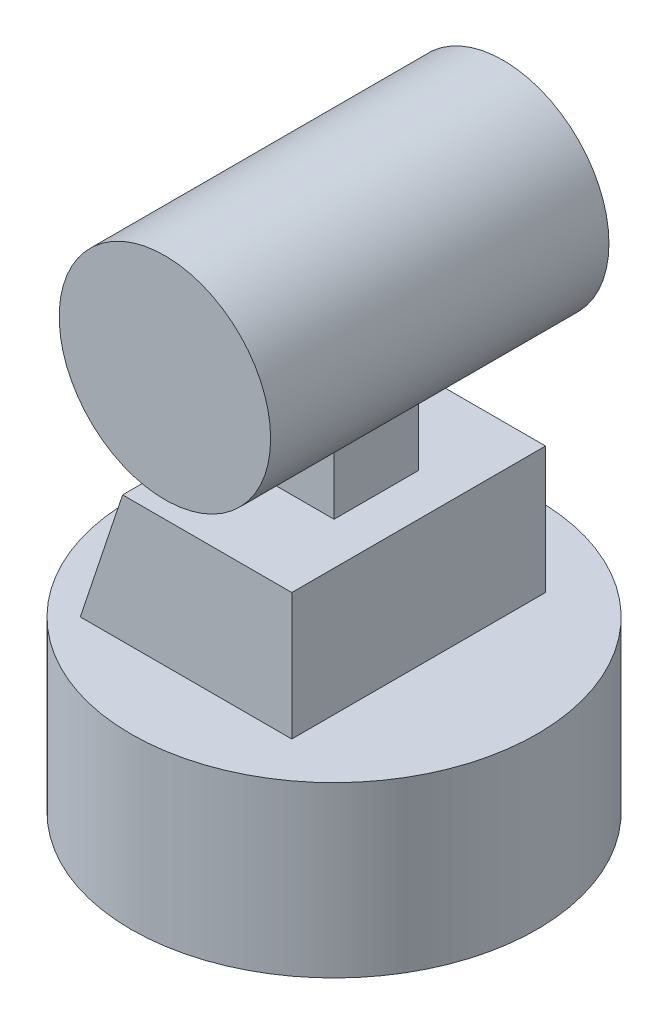
ISO-10303-21;
HEADER;
FILE_DESCRIPTION(('STEP AP214'),'2;1');
FILE_NAME('part.step','',(''),(''),'','','');
FILE_SCHEMA(('AUTOMOTIVE_DESIGN { 1 0 10303 214 1 1 1 1 }'));
ENDSEC;
DATA;
#1=APPLICATION_CONTEXT('core data for automotive mechanical design processes');
#2=APPLICATION_PROTOCOL_DEFINITION('international standard','automotive_design',2000,#1);
#3=PRODUCT_CONTEXT('',#1,'mechanical');
#4=PRODUCT('Part','Part','',(#3));
#5=PRODUCT_RELATED_PRODUCT_CATEGORY('part','',(#4));
#6=PRODUCT_DEFINITION_FORMATION('','',#4);
#7=PRODUCT_DEFINITION_CONTEXT('part definition',#1,'design');
#8=PRODUCT_DEFINITION('design','',#6,#7);
#9=PRODUCT_DEFINITION_SHAPE('','',#8);
#10=(LENGTH_UNIT() NAMED_UNIT(*) SI_UNIT(.MILLI.,.METRE.));
#11=(NAMED_UNIT(*) PLANE_ANGLE_UNIT() SI_UNIT($,.RADIAN.));
#12=(NAMED_UNIT(*) SI_UNIT($,.STERADIAN.) SOLID_ANGLE_UNIT());
#13=UNCERTAINTY_MEASURE_WITH_UNIT(LENGTH_MEASURE(1.E-05),#10,'distance_accuracy_value','');
#14=(GEOMETRIC_REPRESENTATION_CONTEXT(3) GLOBAL_UNCERTAINTY_ASSIGNED_CONTEXT((#13)) GLOBAL_UNIT_ASSIGNED_CONTEXT((#10,
#11,#12)) REPRESENTATION_CONTEXT('',''));
#15=CARTESIAN_POINT('',(0.,0.,0.));
#16=DIRECTION('',(0.,0.,1.));
#17=DIRECTION('',(1.,0.,0.));
#18=AXIS2_PLACEMENT_3D('',#15,#16,#17);
#19=CARTESIAN_POINT('',(0.,54.5,20.));
#20=DIRECTION('',(0.,0.,-1.));
#21=DIRECTION('',(-1.,0.,0.));
#22=AXIS2_PLACEMENT_3D('',#19,#20,#21);
#23=CYLINDRICAL_SURFACE('',#22,12.5);
#24=CARTESIAN_POINT('',(0.,54.5,-20.));
#25=DIRECTION('',(0.,0.,1.));
#26=DIRECTION('',(1.,0.,0.));
#27=AXIS2_PLACEMENT_3D('',#24,#25,#26);
#28=CIRCLE('',#27,12.5);
#29=CARTESIAN_POINT('',(12.5,54.5,-20.));
#30=VERTEX_POINT('',#29);
#31=EDGE_CURVE('E52',#30,#30,#28,.T.);
#32=ORIENTED_EDGE('',*,*,#31,.T.);
#33=EDGE_LOOP('',(#32));
#34=FACE_BOUND('',#33,.T.);
#35=CARTESIAN_POINT('',(0.,54.5,20.));
#36=DIRECTION('',(0.,0.,1.));
#37=DIRECTION('',(1.,0.,0.));
#38=AXIS2_PLACEMENT_3D('',#35,#36,#37);
#39=CIRCLE('',#38,12.5);
#40=CARTESIAN_POINT('',(12.5,54.5,20.));
#41=VERTEX_POINT('',#40);
#42=EDGE_CURVE('E11',#41,#41,#39,.T.);
#43=ORIENTED_EDGE('',*,*,#42,.F.);
#44=EDGE_LOOP('',(#43));
#45=FACE_BOUND('',#44,.T.);
#46=DIRECTION('',(0.,0.,-1.));
#47=VECTOR('',#46,1.);
#48=CARTESIAN_POINT('',(-5.,43.0435607626104,20.));
#49=LINE('',#48,#47);
#50=CARTESIAN_POINT('',(-5.,43.0435607626104,-5.));
#51=VERTEX_POINT('',#50);
#52=CARTESIAN_POINT('',(-5.,43.0435607626104,5.));
#53=VERTEX_POINT('',#52);
#54=EDGE_CURVE('E64',#51,#53,#49,.F.);
#55=ORIENTED_EDGE('',*,*,#54,.T.);
#56=CARTESIAN_POINT('',(0.,54.5,5.));
#57=DIRECTION('',(0.,0.,-1.));
#58=DIRECTION('',(-1.,0.,0.));
#59=AXIS2_PLACEMENT_3D('',#56,#57,#58);
#60=CIRCLE('',#59,12.5);
#61=CARTESIAN_POINT('',(5.,43.0435607626104,5.));
#62=VERTEX_POINT('',#61);
#63=EDGE_CURVE('E68',#53,#62,#60,.F.);
#64=ORIENTED_EDGE('',*,*,#63,.T.);
#65=DIRECTION('',(0.,0.,-1.));
#66=VECTOR('',#65,1.);
#67=CARTESIAN_POINT('',(5.,43.0435607626104,20.));
#68=LINE('',#67,#66);
#69=CARTESIAN_POINT('',(5.,43.0435607626104,-5.));
#70=VERTEX_POINT('',#69);
#71=EDGE_CURVE('E209',#62,#70,#68,.T.);
#72=ORIENTED_EDGE('',*,*,#71,.T.);
#73=CARTESIAN_POINT('',(0.,54.5,-5.));
#74=DIRECTION('',(0.,0.,1.));
#75=DIRECTION('',(1.,0.,0.));
#76=AXIS2_PLACEMENT_3D('',#73,#74,#75);
#77=CIRCLE('',#76,12.5);
#78=EDGE_CURVE('E206',#70,#51,#77,.F.);
#79=ORIENTED_EDGE('',*,*,#78,.T.);
#80=EDGE_LOOP('',(#55,#64,#72,#79));
#81=FACE_BOUND('',#80,.T.);
#82=ADVANCED_FACE('F49',(#34,#45,#81),#23,.T.);
#83=CARTESIAN_POINT('',(0.,54.5,20.));
#84=DIRECTION('',(0.,0.,1.));
#85=DIRECTION('',(1.,0.,0.));
#86=AXIS2_PLACEMENT_3D('',#83,#84,#85);
#87=PLANE('',#86);
#88=ORIENTED_EDGE('',*,*,#42,.T.);
#89=EDGE_LOOP('',(#88));
#90=FACE_BOUND('',#89,.T.);
#91=ADVANCED_FACE('F251',(#90),#87,.T.);
#92=CARTESIAN_POINT('',(0.,54.5,-20.));
#93=DIRECTION('',(0.,0.,1.));
#94=DIRECTION('',(1.,0.,0.));
#95=AXIS2_PLACEMENT_3D('',#92,#93,#94);
#96=PLANE('',#95);
#97=ORIENTED_EDGE('',*,*,#31,.F.);
#98=EDGE_LOOP('',(#97));
#99=FACE_BOUND('',#98,.T.);
#100=ADVANCED_FACE('F248',(#99),#96,.F.);
#101=CARTESIAN_POINT('',(-5.,67.001,-5.));
#102=DIRECTION('',(1.,0.,0.));
#103=DIRECTION('',(0.,0.,-1.));
#104=AXIS2_PLACEMENT_3D('',#101,#102,#103);
#105=PLANE('',#104);
#106=ORIENTED_EDGE('',*,*,#54,.F.);
#107=DIRECTION('',(0.,-1.,0.));
#108=VECTOR('',#107,1.);
#109=CARTESIAN_POINT('',(-5.,67.001,-5.));
#110=LINE('',#109,#108);
#111=CARTESIAN_POINT('',(-5.,35.,-5.));
#112=VERTEX_POINT('',#111);
#113=EDGE_CURVE('E172',#51,#112,#110,.T.);
#114=ORIENTED_EDGE('',*,*,#113,.T.);
#115=DIRECTION('',(0.,0.,1.));
#116=VECTOR('',#115,1.);
#117=CARTESIAN_POINT('',(-5.,35.,-5.));
#118=LINE('',#117,#116);
#119=CARTESIAN_POINT('',(-5.,35.,5.));
#120=VERTEX_POINT('',#119);
#121=EDGE_CURVE('E190',#112,#120,#118,.T.);
#122=ORIENTED_EDGE('',*,*,#121,.T.);
#123=DIRECTION('',(0.,-1.,0.));
#124=VECTOR('',#123,1.);
#125=CARTESIAN_POINT('',(-5.,67.001,5.));
#126=LINE('',#125,#124);
#127=EDGE_CURVE('E189',#53,#120,#126,.T.);
#128=ORIENTED_EDGE('',*,*,#127,.F.);
#129=EDGE_LOOP('',(#106,#114,#122,#128));
#130=FACE_BOUND('',#129,.T.);
#131=ADVANCED_FACE('F250',(#130),#105,.F.);
#132=CARTESIAN_POINT('',(-5.,67.001,5.));
#133=DIRECTION('',(0.,0.,-1.));
#134=DIRECTION('',(-1.,0.,0.));
#135=AXIS2_PLACEMENT_3D('',#132,#133,#134);
#136=PLANE('',#135);
#137=ORIENTED_EDGE('',*,*,#63,.F.);
#138=ORIENTED_EDGE('',*,*,#127,.T.);
#139=DIRECTION('',(1.,0.,0.));
#140=VECTOR('',#139,1.);
#141=CARTESIAN_POINT('',(-5.,35.,5.));
#142=LINE('',#141,#140);
#143=CARTESIAN_POINT('',(5.,35.,5.));
#144=VERTEX_POINT('',#143);
#145=EDGE_CURVE('E185',#120,#144,#142,.T.);
#146=ORIENTED_EDGE('',*,*,#145,.T.);
#147=DIRECTION('',(0.,-1.,0.));
#148=VECTOR('',#147,1.);
#149=CARTESIAN_POINT('',(5.,67.001,5.));
#150=LINE('',#149,#148);
#151=EDGE_CURVE('E184',#62,#144,#150,.T.);
#152=ORIENTED_EDGE('',*,*,#151,.F.);
#153=EDGE_LOOP('',(#137,#138,#146,#152));
#154=FACE_BOUND('',#153,.T.);
#155=ADVANCED_FACE('F255',(#154),#136,.F.);
#156=CARTESIAN_POINT('',(5.,67.001,-5.));
#157=DIRECTION('',(-1.,0.,0.));
#158=DIRECTION('',(0.,0.,1.));
#159=AXIS2_PLACEMENT_3D('',#156,#157,#158);
#160=PLANE('',#159);
#161=ORIENTED_EDGE('',*,*,#71,.F.);
#162=ORIENTED_EDGE('',*,*,#151,.T.);
#163=DIRECTION('',(0.,0.,-1.));
#164=VECTOR('',#163,1.);
#165=CARTESIAN_POINT('',(5.,35.,-5.));
#166=LINE('',#165,#164);
#167=CARTESIAN_POINT('',(5.,35.,-5.));
#168=VERTEX_POINT('',#167);
#169=EDGE_CURVE('E180',#144,#168,#166,.T.);
#170=ORIENTED_EDGE('',*,*,#169,.T.);
#171=DIRECTION('',(0.,-1.,0.));
#172=VECTOR('',#171,1.);
#173=CARTESIAN_POINT('',(5.,67.001,-5.));
#174=LINE('',#173,#172);
#175=EDGE_CURVE('E179',#70,#168,#174,.T.);
#176=ORIENTED_EDGE('',*,*,#175,.F.);
#177=EDGE_LOOP('',(#161,#162,#170,#176));
#178=FACE_BOUND('',#177,.T.);
#179=ADVANCED_FACE('F372',(#178),#160,.F.);
#180=CARTESIAN_POINT('',(-5.,67.001,-5.));
#181=DIRECTION('',(0.,0.,1.));
#182=DIRECTION('',(1.,0.,0.));
#183=AXIS2_PLACEMENT_3D('',#180,#181,#182);
#184=PLANE('',#183);
#185=ORIENTED_EDGE('',*,*,#78,.F.);
#186=ORIENTED_EDGE('',*,*,#175,.T.);
#187=DIRECTION('',(-1.,0.,0.));
#188=VECTOR('',#187,1.);
#189=CARTESIAN_POINT('',(-5.,35.,-5.));
#190=LINE('',#189,#188);
#191=EDGE_CURVE('E176',#168,#112,#190,.T.);
#192=ORIENTED_EDGE('',*,*,#191,.T.);
#193=ORIENTED_EDGE('',*,*,#113,.F.);
#194=EDGE_LOOP('',(#185,#186,#192,#193));
#195=FACE_BOUND('',#194,.T.);
#196=ADVANCED_FACE('F289',(#195),#184,.F.);
#197=CARTESIAN_POINT('',(0.,20.,0.));
#198=DIRECTION('',(0.,1.,0.));
#199=DIRECTION('',(0.,0.,1.));
#200=AXIS2_PLACEMENT_3D('',#197,#198,#199);
#201=PLANE('',#200);
#202=CARTESIAN_POINT('',(0.,20.,0.));
#203=DIRECTION('',(0.,1.,0.));
#204=DIRECTION('',(0.,0.,1.));
#205=AXIS2_PLACEMENT_3D('',#202,#203,#204);
#206=CIRCLE('',#205,24.);
#207=CARTESIAN_POINT('',(0.,20.,24.));
#208=VERTEX_POINT('',#207);
#209=EDGE_CURVE('E168',#208,#208,#206,.T.);
#210=ORIENTED_EDGE('',*,*,#209,.T.);
#211=EDGE_LOOP('',(#210));
#212=FACE_BOUND('',#211,.T.);
#213=DIRECTION('',(0.,0.,-1.));
#214=VECTOR('',#213,1.);
#215=CARTESIAN_POINT('',(-15.,20.,15.));
#216=LINE('',#215,#214);
#217=CARTESIAN_POINT('',(-15.,20.,15.));
#218=VERTEX_POINT('',#217);
#219=CARTESIAN_POINT('',(-15.,20.,-15.));
#220=VERTEX_POINT('',#219);
#221=EDGE_CURVE('E126',#218,#220,#216,.T.);
#222=ORIENTED_EDGE('',*,*,#221,.T.);
#223=DIRECTION('',(1.,0.,0.));
#224=VECTOR('',#223,1.);
#225=CARTESIAN_POINT('',(-15.,20.,-15.));
#226=LINE('',#225,#224);
#227=CARTESIAN_POINT('',(10.,20.,-15.));
#228=VERTEX_POINT('',#227);
#229=EDGE_CURVE('E153',#220,#228,#226,.T.);
#230=ORIENTED_EDGE('',*,*,#229,.T.);
#231=DIRECTION('',(0.,0.,-1.));
#232=VECTOR('',#231,1.);
#233=CARTESIAN_POINT('',(10.,20.,15.));
#234=LINE('',#233,#232);
#235=CARTESIAN_POINT('',(10.,20.,15.));
#236=VERTEX_POINT('',#235);
#237=EDGE_CURVE('E135',#236,#228,#234,.T.);
#238=ORIENTED_EDGE('',*,*,#237,.F.);
#239=DIRECTION('',(1.,0.,0.));
#240=VECTOR('',#239,1.);
#241=CARTESIAN_POINT('',(-15.,20.,15.));
#242=LINE('',#241,#240);
#243=EDGE_CURVE('E115',#218,#236,#242,.T.);
#244=ORIENTED_EDGE('',*,*,#243,.F.);
#245=EDGE_LOOP('',(#222,#230,#238,#244));
#246=FACE_BOUND('',#245,.T.);
#247=ADVANCED_FACE('F138',(#212,#246),#201,.T.);
#248=CARTESIAN_POINT('',(0.,20.,0.));
#249=DIRECTION('',(0.,-1.,0.));
#250=DIRECTION('',(0.,0.,-1.));
#251=AXIS2_PLACEMENT_3D('',#248,#249,#250);
#252=CYLINDRICAL_SURFACE('',#251,24.);
#253=ORIENTED_EDGE('',*,*,#209,.F.);
#254=EDGE_LOOP('',(#253));
#255=FACE_BOUND('',#254,.T.);
#256=CARTESIAN_POINT('',(0.,0.,0.));
#257=DIRECTION('',(0.,1.,0.));
#258=DIRECTION('',(0.,0.,1.));
#259=AXIS2_PLACEMENT_3D('',#256,#257,#258);
#260=CIRCLE('',#259,24.);
#261=CARTESIAN_POINT('',(0.,0.,24.));
#262=VERTEX_POINT('',#261);
#263=EDGE_CURVE('E134',#262,#262,#260,.T.);
#264=ORIENTED_EDGE('',*,*,#263,.T.);
#265=EDGE_LOOP('',(#264));
#266=FACE_BOUND('',#265,.T.);
#267=ADVANCED_FACE('F288',(#255,#266),#252,.T.);
#268=CARTESIAN_POINT('',(0.,0.,0.));
#269=DIRECTION('',(0.,1.,0.));
#270=DIRECTION('',(0.,0.,1.));
#271=AXIS2_PLACEMENT_3D('',#268,#269,#270);
#272=PLANE('',#271);
#273=ORIENTED_EDGE('',*,*,#263,.F.);
#274=EDGE_LOOP('',(#273));
#275=FACE_BOUND('',#274,.T.);
#276=ADVANCED_FACE('F301',(#275),#272,.F.);
#277=CARTESIAN_POINT('',(-15.,20.,15.));
#278=DIRECTION('',(0.948683298050514,-0.316227766016838,0.));
#279=DIRECTION('',(0.316227766016838,0.948683298050514,0.));
#280=AXIS2_PLACEMENT_3D('',#277,#278,#279);
#281=PLANE('',#280);
#282=DIRECTION('',(-0.316227766016838,-0.948683298050514,0.));
#283=VECTOR('',#282,1.);
#284=CARTESIAN_POINT('',(-15.,20.,-15.));
#285=LINE('',#284,#283);
#286=CARTESIAN_POINT('',(-10.,35.,-15.));
#287=VERTEX_POINT('',#286);
#288=EDGE_CURVE('E129',#287,#220,#285,.T.);
#289=ORIENTED_EDGE('',*,*,#288,.T.);
#290=ORIENTED_EDGE('',*,*,#221,.F.);
#291=DIRECTION('',(-0.316227766016838,-0.948683298050514,0.));
#292=VECTOR('',#291,1.);
#293=CARTESIAN_POINT('',(-15.,20.,15.));
#294=LINE('',#293,#292);
#295=CARTESIAN_POINT('',(-10.,35.,15.));
#296=VERTEX_POINT('',#295);
#297=EDGE_CURVE('E111',#296,#218,#294,.T.);
#298=ORIENTED_EDGE('',*,*,#297,.F.);
#299=DIRECTION('',(0.,0.,-1.));
#300=VECTOR('',#299,1.);
#301=CARTESIAN_POINT('',(-10.,35.,15.));
#302=LINE('',#301,#300);
#303=EDGE_CURVE('E150',#296,#287,#302,.T.);
#304=ORIENTED_EDGE('',*,*,#303,.T.);
#305=EDGE_LOOP('',(#289,#290,#298,#304));
#306=FACE_BOUND('',#305,.T.);
#307=ADVANCED_FACE('F127',(#306),#281,.F.);
#308=CARTESIAN_POINT('',(10.,20.,15.));
#309=DIRECTION('',(-1.,0.,0.));
#310=DIRECTION('',(0.,-1.,0.));
#311=AXIS2_PLACEMENT_3D('',#308,#309,#310);
#312=PLANE('',#311);
#313=DIRECTION('',(0.,1.,0.));
#314=VECTOR('',#313,1.);
#315=CARTESIAN_POINT('',(10.,20.,-15.));
#316=LINE('',#315,#314);
#317=CARTESIAN_POINT('',(10.,35.,-15.));
#318=VERTEX_POINT('',#317);
#319=EDGE_CURVE('E156',#228,#318,#316,.T.);
#320=ORIENTED_EDGE('',*,*,#319,.T.);
#321=DIRECTION('',(0.,0.,-1.));
#322=VECTOR('',#321,1.);
#323=CARTESIAN_POINT('',(10.,35.,15.));
#324=LINE('',#323,#322);
#325=CARTESIAN_POINT('',(10.,35.,15.));
#326=VERTEX_POINT('',#325);
#327=EDGE_CURVE('E162',#326,#318,#324,.T.);
#328=ORIENTED_EDGE('',*,*,#327,.F.);
#329=DIRECTION('',(0.,1.,0.));
#330=VECTOR('',#329,1.);
#331=CARTESIAN_POINT('',(10.,20.,15.));
#332=LINE('',#331,#330);
#333=EDGE_CURVE('E140',#236,#326,#332,.T.);
#334=ORIENTED_EDGE('',*,*,#333,.F.);
#335=ORIENTED_EDGE('',*,*,#237,.T.);
#336=EDGE_LOOP('',(#320,#328,#334,#335));
#337=FACE_BOUND('',#336,.T.);
#338=ADVANCED_FACE('F319',(#337),#312,.F.);
#339=CARTESIAN_POINT('',(-10.,35.,15.));
#340=DIRECTION('',(0.,-1.,0.));
#341=DIRECTION('',(0.,0.,-1.));
#342=AXIS2_PLACEMENT_3D('',#339,#340,#341);
#343=PLANE('',#342);
#344=ORIENTED_EDGE('',*,*,#121,.F.);
#345=ORIENTED_EDGE('',*,*,#191,.F.);
#346=ORIENTED_EDGE('',*,*,#169,.F.);
#347=ORIENTED_EDGE('',*,*,#145,.F.);
#348=EDGE_LOOP('',(#344,#345,#346,#347));
#349=FACE_BOUND('',#348,.T.);
#350=DIRECTION('',(-1.,0.,0.));
#351=VECTOR('',#350,1.);
#352=CARTESIAN_POINT('',(-10.,35.,-15.));
#353=LINE('',#352,#351);
#354=EDGE_CURVE('E123',#318,#287,#353,.T.);
#355=ORIENTED_EDGE('',*,*,#354,.T.);
#356=ORIENTED_EDGE('',*,*,#303,.F.);
#357=DIRECTION('',(-1.,0.,0.));
#358=VECTOR('',#357,1.);
#359=CARTESIAN_POINT('',(-10.,35.,15.));
#360=LINE('',#359,#358);
#361=EDGE_CURVE('E118',#326,#296,#360,.T.);
#362=ORIENTED_EDGE('',*,*,#361,.F.);
#363=ORIENTED_EDGE('',*,*,#327,.T.);
#364=EDGE_LOOP('',(#355,#356,#362,#363));
#365=FACE_BOUND('',#364,.T.);
#366=ADVANCED_FACE('F328',(#349,#365),#343,.F.);
#367=CARTESIAN_POINT('',(0.,0.,15.));
#368=DIRECTION('',(0.,0.,-1.));
#369=DIRECTION('',(-1.,0.,0.));
#370=AXIS2_PLACEMENT_3D('',#367,#368,#369);
#371=PLANE('',#370);
#372=ORIENTED_EDGE('',*,*,#297,.T.);
#373=ORIENTED_EDGE('',*,*,#243,.T.);
#374=ORIENTED_EDGE('',*,*,#333,.T.);
#375=ORIENTED_EDGE('',*,*,#361,.T.);
#376=EDGE_LOOP('',(#372,#373,#374,#375));
#377=FACE_BOUND('',#376,.T.);
#378=ADVANCED_FACE('F113',(#377),#371,.F.);
#379=CARTESIAN_POINT('',(0.,0.,-15.));
#380=DIRECTION('',(0.,0.,-1.));
#381=DIRECTION('',(-1.,0.,0.));
#382=AXIS2_PLACEMENT_3D('',#379,#380,#381);
#383=PLANE('',#382);
#384=ORIENTED_EDGE('',*,*,#288,.F.);
#385=ORIENTED_EDGE('',*,*,#354,.F.);
#386=ORIENTED_EDGE('',*,*,#319,.F.);
#387=ORIENTED_EDGE('',*,*,#229,.F.);
#388=EDGE_LOOP('',(#384,#385,#386,#387));
#389=FACE_BOUND('',#388,.T.);
#390=ADVANCED_FACE('F347',(#389),#383,.T.);
#391=CLOSED_SHELL('',(#82,#91,#100,#131,#155,#179,#196,#247,#267,#276,#307,#338,#366,#378,#390));
#392=MANIFOLD_SOLID_BREP('B2',#391);
#393=ADVANCED_BREP_SHAPE_REPRESENTATION('',(#18,#392),#14);
#394=SHAPE_DEFINITION_REPRESENTATION(#9,#393);
ENDSEC;
END-ISO-10303-21;
